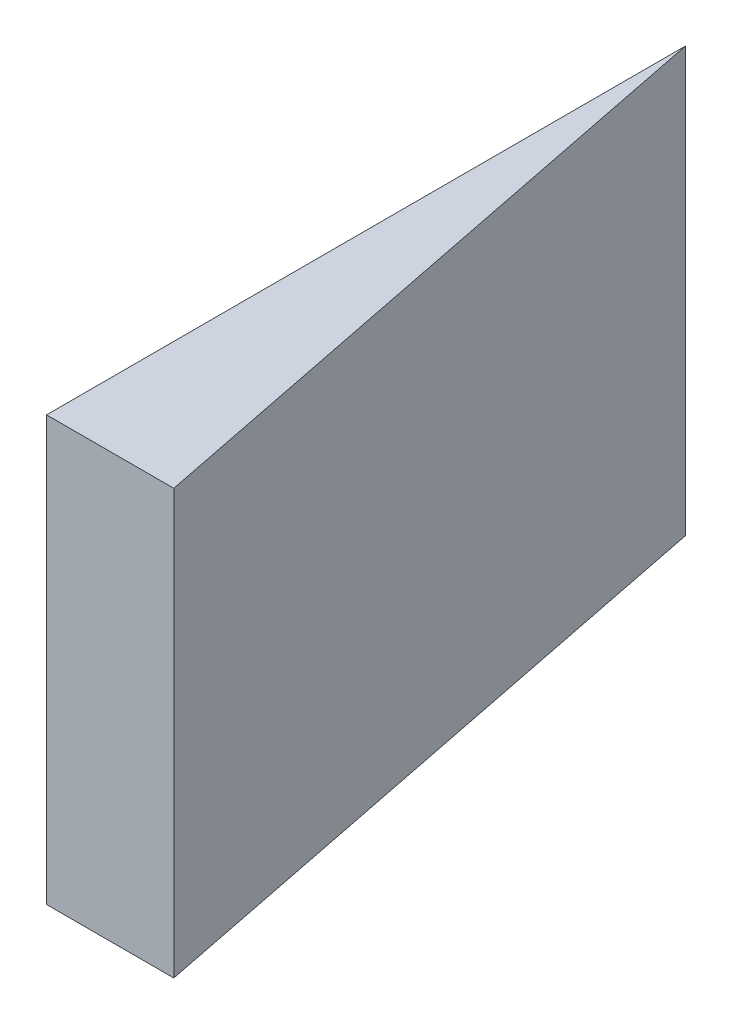
ISO-10303-21;
HEADER;
FILE_DESCRIPTION(('STEP AP214'),'2;1');
FILE_NAME('part.step','',(''),(''),'','','');
FILE_SCHEMA(('AUTOMOTIVE_DESIGN { 1 0 10303 214 1 1 1 1 }'));
ENDSEC;
DATA;
#1=APPLICATION_CONTEXT('core data for automotive mechanical design processes');
#2=APPLICATION_PROTOCOL_DEFINITION('international standard','automotive_design',2000,#1);
#3=PRODUCT_CONTEXT('',#1,'mechanical');
#4=PRODUCT('Part','Part','',(#3));
#5=PRODUCT_RELATED_PRODUCT_CATEGORY('part','',(#4));
#6=PRODUCT_DEFINITION_FORMATION('','',#4);
#7=PRODUCT_DEFINITION_CONTEXT('part definition',#1,'design');
#8=PRODUCT_DEFINITION('design','',#6,#7);
#9=PRODUCT_DEFINITION_SHAPE('','',#8);
#10=(LENGTH_UNIT() NAMED_UNIT(*) SI_UNIT(.MILLI.,.METRE.));
#11=(NAMED_UNIT(*) PLANE_ANGLE_UNIT() SI_UNIT($,.RADIAN.));
#12=(NAMED_UNIT(*) SI_UNIT($,.STERADIAN.) SOLID_ANGLE_UNIT());
#13=UNCERTAINTY_MEASURE_WITH_UNIT(LENGTH_MEASURE(1.E-05),#10,'distance_accuracy_value','');
#14=(GEOMETRIC_REPRESENTATION_CONTEXT(3) GLOBAL_UNCERTAINTY_ASSIGNED_CONTEXT((#13)) GLOBAL_UNIT_ASSIGNED_CONTEXT((#10,
#11,#12)) REPRESENTATION_CONTEXT('',''));
#15=CARTESIAN_POINT('',(0.,0.,0.));
#16=DIRECTION('',(0.,0.,1.));
#17=DIRECTION('',(1.,0.,0.));
#18=AXIS2_PLACEMENT_3D('',#15,#16,#17);
#19=CARTESIAN_POINT('',(3.37532170631,-0.750000045305344,-5.23287741907118));
#20=DIRECTION('',(0.,1.,8.74227765734759E-08));
#21=DIRECTION('',(-1.,0.,0.));
#22=AXIS2_PLACEMENT_3D('',#19,#20,#21);
#23=PLANE('',#22);
#24=DIRECTION('',(-0.195310522456618,8.57391410123928E-08,-0.980741454114037));
#25=VECTOR('',#24,1.);
#26=CARTESIAN_POINT('',(3.3,-0.750000183586831,-3.65112158656318));
#27=LINE('',#26,#25);
#28=CARTESIAN_POINT('',(3.3,-0.750000183588831,-3.65112158656418));
#29=VERTEX_POINT('',#28);
#30=CARTESIAN_POINT('',(3.,-0.750000051892177,-5.15755571276018));
#31=VERTEX_POINT('',#30);
#32=EDGE_CURVE('E11',#29,#31,#27,.T.);
#33=ORIENTED_EDGE('',*,*,#32,.T.);
#34=DIRECTION('',(0.,-8.74227765663743E-08,0.999999999999996));
#35=VECTOR('',#34,1.);
#36=CARTESIAN_POINT('',(3.,-0.750000051890177,-5.15755571276118));
#37=LINE('',#36,#35);
#38=CARTESIAN_POINT('',(3.,-0.750000183588831,-3.65112158656318));
#39=VERTEX_POINT('',#38);
#40=EDGE_CURVE('E49',#31,#39,#37,.T.);
#41=ORIENTED_EDGE('',*,*,#40,.T.);
#42=DIRECTION('',(1.,0.,0.));
#43=VECTOR('',#42,1.);
#44=CARTESIAN_POINT('',(3.,-0.750000183586831,-3.65112158656318));
#45=LINE('',#44,#43);
#46=EDGE_CURVE('E47',#39,#29,#45,.T.);
#47=ORIENTED_EDGE('',*,*,#46,.T.);
#48=EDGE_LOOP('',(#33,#41,#47));
#49=FACE_BOUND('',#48,.T.);
#50=ADVANCED_FACE('F17',(#49),#23,.T.);
#51=CARTESIAN_POINT('',(3.37532170631,-1.75000004530634,-5.23287750649395));
#52=DIRECTION('',(0.,1.,8.74227765734759E-08));
#53=DIRECTION('',(-1.,0.,0.));
#54=AXIS2_PLACEMENT_3D('',#51,#52,#53);
#55=PLANE('',#54);
#56=DIRECTION('',(1.,0.,0.));
#57=VECTOR('',#56,1.);
#58=CARTESIAN_POINT('',(3.,-1.75000018358783,-3.65112167398595));
#59=LINE('',#58,#57);
#60=CARTESIAN_POINT('',(3.,-1.75000018358683,-3.65112167398595));
#61=VERTEX_POINT('',#60);
#62=CARTESIAN_POINT('',(3.3,-1.75000018358683,-3.65112167398695));
#63=VERTEX_POINT('',#62);
#64=EDGE_CURVE('E24',#61,#63,#59,.T.);
#65=ORIENTED_EDGE('',*,*,#64,.F.);
#66=DIRECTION('',(0.,-8.74227765663743E-08,0.999999999999996));
#67=VECTOR('',#66,1.);
#68=CARTESIAN_POINT('',(3.,-1.75000005189118,-5.15755580018395));
#69=LINE('',#68,#67);
#70=CARTESIAN_POINT('',(3.,-1.75000005189018,-5.15755580018295));
#71=VERTEX_POINT('',#70);
#72=EDGE_CURVE('E53',#71,#61,#69,.T.);
#73=ORIENTED_EDGE('',*,*,#72,.F.);
#74=DIRECTION('',(-0.195310522456618,8.57391410123928E-08,-0.980741454114037));
#75=VECTOR('',#74,1.);
#76=CARTESIAN_POINT('',(3.3,-1.75000018358783,-3.65112167398595));
#77=LINE('',#76,#75);
#78=EDGE_CURVE('E68',#63,#71,#77,.T.);
#79=ORIENTED_EDGE('',*,*,#78,.F.);
#80=EDGE_LOOP('',(#65,#73,#79));
#81=FACE_BOUND('',#80,.T.);
#82=ADVANCED_FACE('F73',(#81),#55,.F.);
#83=CARTESIAN_POINT('',(3.3,-0.750000183586831,-3.65112158656318));
#84=DIRECTION('',(-0.980741454114041,-1.70745881893227E-08,0.195310522456619));
#85=DIRECTION('',(-0.195310522456619,8.57391410193576E-08,-0.980741454114041));
#86=AXIS2_PLACEMENT_3D('',#83,#84,#85);
#87=PLANE('',#86);
#88=DIRECTION('',(0.,-0.999999999999996,-8.74227765733881E-08));
#89=VECTOR('',#88,1.);
#90=CARTESIAN_POINT('',(3.3,-0.75000018358683,-3.65112158656318));
#91=LINE('',#90,#89);
#92=EDGE_CURVE('E59',#29,#63,#91,.T.);
#93=ORIENTED_EDGE('',*,*,#92,.T.);
#94=ORIENTED_EDGE('',*,*,#78,.T.);
#95=DIRECTION('',(0.,-0.999999999999996,-8.74227765733881E-08));
#96=VECTOR('',#95,1.);
#97=CARTESIAN_POINT('',(3.,-0.750000051890177,-5.15755571276118));
#98=LINE('',#97,#96);
#99=EDGE_CURVE('E54',#31,#71,#98,.T.);
#100=ORIENTED_EDGE('',*,*,#99,.F.);
#101=ORIENTED_EDGE('',*,*,#32,.F.);
#102=EDGE_LOOP('',(#93,#94,#100,#101));
#103=FACE_BOUND('',#102,.T.);
#104=ADVANCED_FACE('F57',(#103),#87,.F.);
#105=CARTESIAN_POINT('',(3.,-0.750000051890177,-5.15755571276118));
#106=DIRECTION('',(1.,0.,0.));
#107=DIRECTION('',(0.,-8.74227765734759E-08,1.));
#108=AXIS2_PLACEMENT_3D('',#105,#106,#107);
#109=PLANE('',#108);
#110=ORIENTED_EDGE('',*,*,#99,.T.);
#111=ORIENTED_EDGE('',*,*,#72,.T.);
#112=DIRECTION('',(0.,-0.999999999999996,-8.74227765733881E-08));
#113=VECTOR('',#112,1.);
#114=CARTESIAN_POINT('',(3.,-0.750000183586831,-3.65112158656318));
#115=LINE('',#114,#113);
#116=EDGE_CURVE('E70',#39,#61,#115,.T.);
#117=ORIENTED_EDGE('',*,*,#116,.F.);
#118=ORIENTED_EDGE('',*,*,#40,.F.);
#119=EDGE_LOOP('',(#110,#111,#117,#118));
#120=FACE_BOUND('',#119,.T.);
#121=ADVANCED_FACE('F72',(#120),#109,.F.);
#122=CARTESIAN_POINT('',(3.,-0.750000183586831,-3.65112158656318));
#123=DIRECTION('',(0.,8.74227765734759E-08,-1.));
#124=DIRECTION('',(1.,0.,0.));
#125=AXIS2_PLACEMENT_3D('',#122,#123,#124);
#126=PLANE('',#125);
#127=ORIENTED_EDGE('',*,*,#116,.T.);
#128=ORIENTED_EDGE('',*,*,#64,.T.);
#129=ORIENTED_EDGE('',*,*,#92,.F.);
#130=ORIENTED_EDGE('',*,*,#46,.F.);
#131=EDGE_LOOP('',(#127,#128,#129,#130));
#132=FACE_BOUND('',#131,.T.);
#133=ADVANCED_FACE('F61',(#132),#126,.F.);
#134=CLOSED_SHELL('',(#50,#82,#104,#121,#133));
#135=MANIFOLD_SOLID_BREP('B1',#134);
#136=ADVANCED_BREP_SHAPE_REPRESENTATION('',(#18,#135),#14);
#137=SHAPE_DEFINITION_REPRESENTATION(#9,#136);
ENDSEC;
END-ISO-10303-21;
